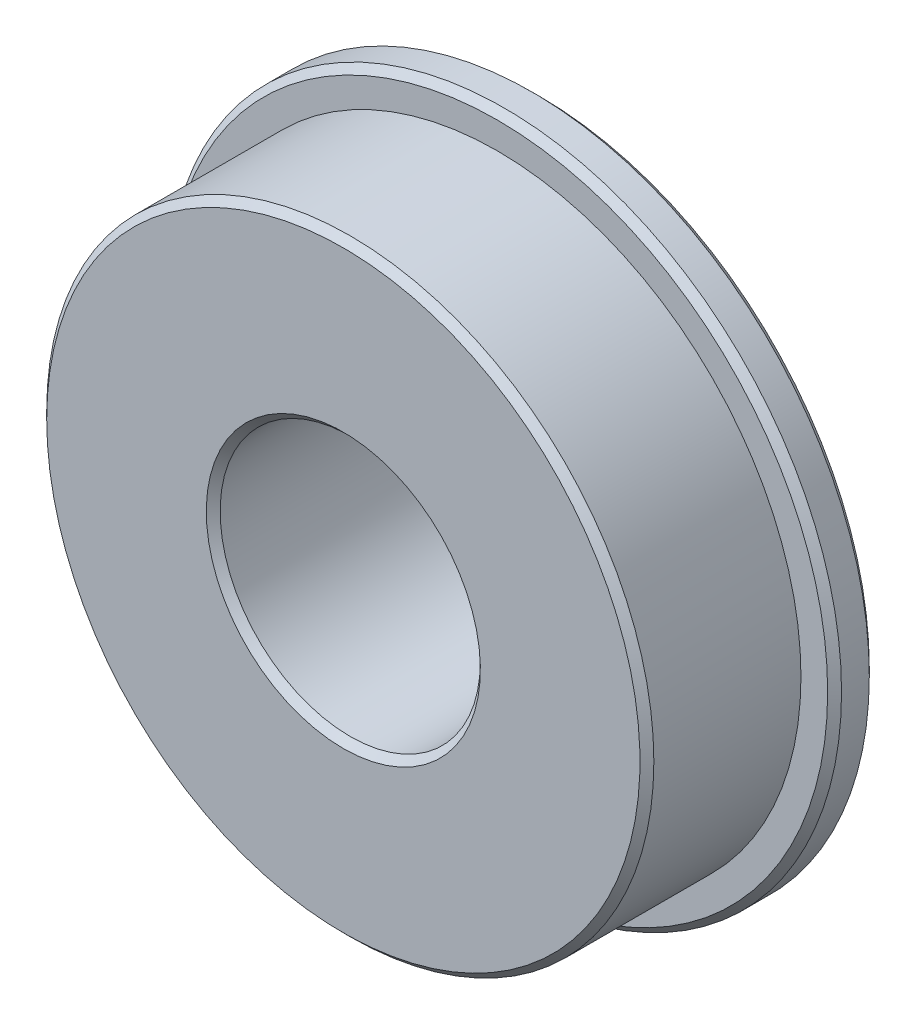
ISO-10303-21;
HEADER;
FILE_DESCRIPTION(('STEP AP214'),'2;1');
FILE_NAME('part.step','',(''),(''),'','','');
FILE_SCHEMA(('AUTOMOTIVE_DESIGN { 1 0 10303 214 1 1 1 1 }'));
ENDSEC;
DATA;
#1=APPLICATION_CONTEXT('core data for automotive mechanical design processes');
#2=APPLICATION_PROTOCOL_DEFINITION('international standard','automotive_design',2000,#1);
#3=PRODUCT_CONTEXT('',#1,'mechanical');
#4=PRODUCT('Part','Part','',(#3));
#5=PRODUCT_RELATED_PRODUCT_CATEGORY('part','',(#4));
#6=PRODUCT_DEFINITION_FORMATION('','',#4);
#7=PRODUCT_DEFINITION_CONTEXT('part definition',#1,'design');
#8=PRODUCT_DEFINITION('design','',#6,#7);
#9=PRODUCT_DEFINITION_SHAPE('','',#8);
#10=(LENGTH_UNIT() NAMED_UNIT(*) SI_UNIT(.MILLI.,.METRE.));
#11=(NAMED_UNIT(*) PLANE_ANGLE_UNIT() SI_UNIT($,.RADIAN.));
#12=(NAMED_UNIT(*) SI_UNIT($,.STERADIAN.) SOLID_ANGLE_UNIT());
#13=UNCERTAINTY_MEASURE_WITH_UNIT(LENGTH_MEASURE(1.E-05),#10,'distance_accuracy_value','');
#14=(GEOMETRIC_REPRESENTATION_CONTEXT(3) GLOBAL_UNCERTAINTY_ASSIGNED_CONTEXT((#13)) GLOBAL_UNIT_ASSIGNED_CONTEXT((#10,
#11,#12)) REPRESENTATION_CONTEXT('',''));
#15=CARTESIAN_POINT('',(0.,0.,0.));
#16=DIRECTION('',(0.,0.,1.));
#17=DIRECTION('',(1.,0.,0.));
#18=AXIS2_PLACEMENT_3D('',#15,#16,#17);
#19=CARTESIAN_POINT('',(-8.86153846153845,6.04195804195806,6.90880000000005));
#20=DIRECTION('',(0.,0.,-1.));
#21=DIRECTION('',(-1.,0.,0.));
#22=AXIS2_PLACEMENT_3D('',#19,#20,#21);
#23=CONICAL_SURFACE('',#22,11.1125,0.785398163397452);
#24=CARTESIAN_POINT('',(-8.86153846153845,6.04195804195806,7.16280000000004));
#25=DIRECTION('',(0.,0.,-1.));
#26=DIRECTION('',(-1.,0.,0.));
#27=AXIS2_PLACEMENT_3D('',#24,#25,#26);
#28=CIRCLE('',#27,10.8585);
#29=CARTESIAN_POINT('',(-19.7200384615385,6.04195804195806,7.16280000000004));
#30=VERTEX_POINT('',#29);
#31=EDGE_CURVE('E18',#30,#30,#28,.T.);
#32=ORIENTED_EDGE('',*,*,#31,.T.);
#33=EDGE_LOOP('',(#32));
#34=FACE_BOUND('',#33,.T.);
#35=CARTESIAN_POINT('',(-8.86153846153845,6.04195804195806,6.90880000000005));
#36=DIRECTION('',(0.,0.,1.));
#37=DIRECTION('',(1.,0.,0.));
#38=AXIS2_PLACEMENT_3D('',#35,#36,#37);
#39=CIRCLE('',#38,11.1125);
#40=CARTESIAN_POINT('',(2.25096153846156,6.04195804195806,6.90880000000005));
#41=VERTEX_POINT('',#40);
#42=EDGE_CURVE('E30',#41,#41,#39,.F.);
#43=ORIENTED_EDGE('',*,*,#42,.F.);
#44=EDGE_LOOP('',(#43));
#45=FACE_BOUND('',#44,.T.);
#46=ADVANCED_FACE('F15',(#34,#45),#23,.T.);
#47=CARTESIAN_POINT('',(-8.86153846153845,6.04195804195806,7.16280000000002));
#48=DIRECTION('',(0.,0.,1.));
#49=DIRECTION('',(1.,0.,0.));
#50=AXIS2_PLACEMENT_3D('',#47,#48,#49);
#51=CYLINDRICAL_SURFACE('',#50,11.1125);
#52=CARTESIAN_POINT('',(-8.86153846153845,6.04195804195806,1.52399999999997));
#53=DIRECTION('',(0.,0.,1.));
#54=DIRECTION('',(1.,0.,0.));
#55=AXIS2_PLACEMENT_3D('',#52,#53,#54);
#56=CIRCLE('',#55,11.1125);
#57=CARTESIAN_POINT('',(2.25096153846156,6.04195804195806,1.52399999999997));
#58=VERTEX_POINT('',#57);
#59=EDGE_CURVE('E39',#58,#58,#56,.T.);
#60=ORIENTED_EDGE('',*,*,#59,.T.);
#61=EDGE_LOOP('',(#60));
#62=FACE_BOUND('',#61,.T.);
#63=ORIENTED_EDGE('',*,*,#42,.T.);
#64=EDGE_LOOP('',(#63));
#65=FACE_BOUND('',#64,.T.);
#66=ADVANCED_FACE('F49',(#62,#65),#51,.T.);
#67=CARTESIAN_POINT('',(-8.86153846153845,6.04195804195806,7.16280000000002));
#68=DIRECTION('',(0.,0.,-1.));
#69=DIRECTION('',(-1.,0.,0.));
#70=AXIS2_PLACEMENT_3D('',#67,#68,#69);
#71=PLANE('',#70);
#72=ORIENTED_EDGE('',*,*,#31,.F.);
#73=EDGE_LOOP('',(#72));
#74=FACE_BOUND('',#73,.T.);
#75=CARTESIAN_POINT('',(-8.86153846153845,6.04195804195806,7.16280000011693));
#76=DIRECTION('',(0.,0.,1.));
#77=DIRECTION('',(0.,-1.,0.));
#78=AXIS2_PLACEMENT_3D('',#75,#76,#77);
#79=CIRCLE('',#78,5.01650000001817);
#80=CARTESIAN_POINT('',(-8.86153846153845,1.0254580419399,7.16280000011693));
#81=VERTEX_POINT('',#80);
#82=EDGE_CURVE('E37',#81,#81,#79,.F.);
#83=ORIENTED_EDGE('',*,*,#82,.T.);
#84=EDGE_LOOP('',(#83));
#85=FACE_BOUND('',#84,.T.);
#86=ADVANCED_FACE('F56',(#74,#85),#71,.F.);
#87=CARTESIAN_POINT('',(-8.86153846153845,6.04195804195806,1.52399999999997));
#88=DIRECTION('',(0.,0.,-1.));
#89=DIRECTION('',(-1.,0.,0.));
#90=AXIS2_PLACEMENT_3D('',#87,#88,#89);
#91=PLANE('',#90);
#92=ORIENTED_EDGE('',*,*,#59,.F.);
#93=EDGE_LOOP('',(#92));
#94=FACE_BOUND('',#93,.T.);
#95=CARTESIAN_POINT('',(-8.86153846153845,6.04195804195806,1.52399999999998));
#96=DIRECTION('',(0.,0.,-1.));
#97=DIRECTION('',(-1.,0.,0.));
#98=AXIS2_PLACEMENT_3D('',#95,#96,#97);
#99=CIRCLE('',#98,12.0904);
#100=CARTESIAN_POINT('',(-20.9519384615385,6.04195804195806,1.52399999999998));
#101=VERTEX_POINT('',#100);
#102=EDGE_CURVE('E33',#101,#101,#99,.T.);
#103=ORIENTED_EDGE('',*,*,#102,.F.);
#104=EDGE_LOOP('',(#103));
#105=FACE_BOUND('',#104,.T.);
#106=ADVANCED_FACE('F87',(#94,#105),#91,.F.);
#107=CARTESIAN_POINT('',(-8.86153846153845,6.04195804195806,7.16280000011693));
#108=DIRECTION('',(0.,0.,1.));
#109=DIRECTION('',(0.,-1.,0.));
#110=AXIS2_PLACEMENT_3D('',#107,#108,#109);
#111=CONICAL_SURFACE('',#110,5.01650000001817,0.785398163397448);
#112=CARTESIAN_POINT('',(-8.86153846153845,6.04195804195806,6.90880000000005));
#113=DIRECTION('',(0.,0.,1.));
#114=DIRECTION('',(1.,0.,0.));
#115=AXIS2_PLACEMENT_3D('',#112,#113,#114);
#116=CIRCLE('',#115,4.7625);
#117=CARTESIAN_POINT('',(-4.09903846153845,6.04195804195806,6.90880000000005));
#118=VERTEX_POINT('',#117);
#119=EDGE_CURVE('E36',#118,#118,#116,.F.);
#120=ORIENTED_EDGE('',*,*,#119,.T.);
#121=EDGE_LOOP('',(#120));
#122=FACE_BOUND('',#121,.T.);
#123=ORIENTED_EDGE('',*,*,#82,.F.);
#124=EDGE_LOOP('',(#123));
#125=FACE_BOUND('',#124,.T.);
#126=ADVANCED_FACE('F83',(#122,#125),#111,.F.);
#127=CARTESIAN_POINT('',(-8.86153846153845,6.04195804195806,1.27));
#128=DIRECTION('',(0.,0.,-1.));
#129=DIRECTION('',(-1.,0.,0.));
#130=AXIS2_PLACEMENT_3D('',#127,#128,#129);
#131=CONICAL_SURFACE('',#130,12.3444,0.78539816339745);
#132=CARTESIAN_POINT('',(-8.86153846153845,6.04195804195806,1.26999999999999));
#133=DIRECTION('',(0.,0.,1.));
#134=DIRECTION('',(1.,0.,0.));
#135=AXIS2_PLACEMENT_3D('',#132,#133,#134);
#136=CIRCLE('',#135,12.3444);
#137=CARTESIAN_POINT('',(3.48286153846156,6.04195804195806,1.26999999999999));
#138=VERTEX_POINT('',#137);
#139=EDGE_CURVE('E176',#138,#138,#136,.F.);
#140=ORIENTED_EDGE('',*,*,#139,.F.);
#141=EDGE_LOOP('',(#140));
#142=FACE_BOUND('',#141,.T.);
#143=ORIENTED_EDGE('',*,*,#102,.T.);
#144=EDGE_LOOP('',(#143));
#145=FACE_BOUND('',#144,.T.);
#146=ADVANCED_FACE('F79',(#142,#145),#131,.T.);
#147=CARTESIAN_POINT('',(-8.86153846153845,6.04195804195806,1.52399999999997));
#148=DIRECTION('',(0.,0.,1.));
#149=DIRECTION('',(1.,0.,0.));
#150=AXIS2_PLACEMENT_3D('',#147,#148,#149);
#151=CYLINDRICAL_SURFACE('',#150,4.7625);
#152=ORIENTED_EDGE('',*,*,#119,.F.);
#153=EDGE_LOOP('',(#152));
#154=FACE_BOUND('',#153,.T.);
#155=CARTESIAN_POINT('',(-8.86153846153845,6.04195804195806,0.253999999983989));
#156=DIRECTION('',(0.,0.,-1.));
#157=DIRECTION('',(-1.,0.,0.));
#158=AXIS2_PLACEMENT_3D('',#155,#156,#157);
#159=CIRCLE('',#158,4.76249999990543);
#160=CARTESIAN_POINT('',(-13.6240384614439,6.04195804195806,0.253999999983989));
#161=VERTEX_POINT('',#160);
#162=EDGE_CURVE('E178',#161,#161,#159,.T.);
#163=ORIENTED_EDGE('',*,*,#162,.T.);
#164=EDGE_LOOP('',(#163));
#165=FACE_BOUND('',#164,.T.);
#166=ADVANCED_FACE('F75',(#154,#165),#151,.F.);
#167=CARTESIAN_POINT('',(-8.86153846153845,6.04195804195806,1.52399999999997));
#168=DIRECTION('',(0.,0.,1.));
#169=DIRECTION('',(1.,0.,0.));
#170=AXIS2_PLACEMENT_3D('',#167,#168,#169);
#171=CYLINDRICAL_SURFACE('',#170,12.3444);
#172=CARTESIAN_POINT('',(-8.86153846153845,6.04195804195806,0.25399999999999));
#173=DIRECTION('',(0.,0.,1.));
#174=DIRECTION('',(1.,0.,0.));
#175=AXIS2_PLACEMENT_3D('',#172,#173,#174);
#176=CIRCLE('',#175,12.3444);
#177=CARTESIAN_POINT('',(3.48286153846154,6.04195804195807,0.25399999999999));
#178=VERTEX_POINT('',#177);
#179=EDGE_CURVE('E27',#178,#178,#176,.F.);
#180=ORIENTED_EDGE('',*,*,#179,.F.);
#181=EDGE_LOOP('',(#180));
#182=FACE_BOUND('',#181,.T.);
#183=ORIENTED_EDGE('',*,*,#139,.T.);
#184=EDGE_LOOP('',(#183));
#185=FACE_BOUND('',#184,.T.);
#186=ADVANCED_FACE('F71',(#182,#185),#171,.T.);
#187=CARTESIAN_POINT('',(-8.86153846153845,6.04195804195806,-5.6843418860808E-11));
#188=DIRECTION('',(0.,0.,-1.));
#189=DIRECTION('',(-1.,0.,0.));
#190=AXIS2_PLACEMENT_3D('',#187,#188,#189);
#191=CONICAL_SURFACE('',#190,5.01650000000311,0.785398163509345);
#192=ORIENTED_EDGE('',*,*,#162,.F.);
#193=EDGE_LOOP('',(#192));
#194=FACE_BOUND('',#193,.T.);
#195=CARTESIAN_POINT('',(-8.86153846153845,6.04195804195806,-6.43721187448625E-11));
#196=DIRECTION('',(0.,0.,-1.));
#197=DIRECTION('',(-1.,0.,0.));
#198=AXIS2_PLACEMENT_3D('',#195,#196,#197);
#199=CIRCLE('',#198,5.01650000001064);
#200=CARTESIAN_POINT('',(-13.8780384615491,6.04195804195806,-6.43721187448625E-11));
#201=VERTEX_POINT('',#200);
#202=EDGE_CURVE('E22',#201,#201,#199,.F.);
#203=ORIENTED_EDGE('',*,*,#202,.F.);
#204=EDGE_LOOP('',(#203));
#205=FACE_BOUND('',#204,.T.);
#206=ADVANCED_FACE('F64',(#194,#205),#191,.F.);
#207=CARTESIAN_POINT('',(-8.86153846153845,6.04195804195806,0.253999999999992));
#208=DIRECTION('',(0.,0.,1.));
#209=DIRECTION('',(1.,0.,0.));
#210=AXIS2_PLACEMENT_3D('',#207,#208,#209);
#211=CONICAL_SURFACE('',#210,12.3444,0.785398163397453);
#212=ORIENTED_EDGE('',*,*,#179,.T.);
#213=EDGE_LOOP('',(#212));
#214=FACE_BOUND('',#213,.T.);
#215=CARTESIAN_POINT('',(-8.86153846153845,6.04195804195806,0.));
#216=DIRECTION('',(0.,0.,1.));
#217=DIRECTION('',(1.,0.,0.));
#218=AXIS2_PLACEMENT_3D('',#215,#216,#217);
#219=CIRCLE('',#218,12.0904);
#220=CARTESIAN_POINT('',(3.22886153846155,6.04195804195806,0.));
#221=VERTEX_POINT('',#220);
#222=EDGE_CURVE('E10',#221,#221,#219,.F.);
#223=ORIENTED_EDGE('',*,*,#222,.F.);
#224=EDGE_LOOP('',(#223));
#225=FACE_BOUND('',#224,.T.);
#226=ADVANCED_FACE('F59',(#214,#225),#211,.T.);
#227=CARTESIAN_POINT('',(-8.86153846153845,6.04195804195806,0.));
#228=DIRECTION('',(0.,0.,-1.));
#229=DIRECTION('',(-1.,0.,0.));
#230=AXIS2_PLACEMENT_3D('',#227,#228,#229);
#231=PLANE('',#230);
#232=ORIENTED_EDGE('',*,*,#222,.T.);
#233=EDGE_LOOP('',(#232));
#234=FACE_BOUND('',#233,.T.);
#235=ORIENTED_EDGE('',*,*,#202,.T.);
#236=EDGE_LOOP('',(#235));
#237=FACE_BOUND('',#236,.T.);
#238=ADVANCED_FACE('F57',(#234,#237),#231,.T.);
#239=CLOSED_SHELL('',(#46,#66,#86,#106,#126,#146,#166,#186,#206,#226,#238));
#240=MANIFOLD_SOLID_BREP('B1',#239);
#241=ADVANCED_BREP_SHAPE_REPRESENTATION('',(#18,#240),#14);
#242=SHAPE_DEFINITION_REPRESENTATION(#9,#241);
ENDSEC;
END-ISO-10303-21;
